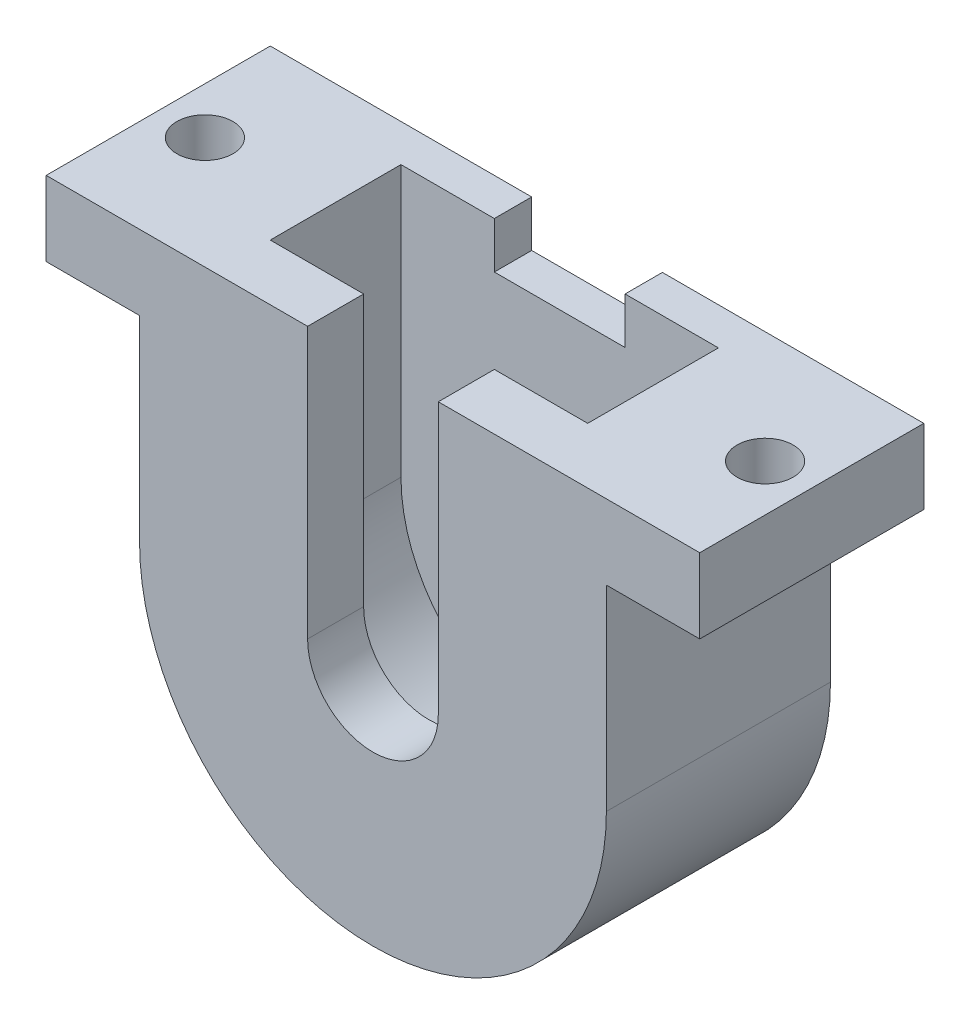
ISO-10303-21;
HEADER;
FILE_DESCRIPTION(('STEP AP214'),'2;1');
FILE_NAME('part.step','',(''),(''),'','','');
FILE_SCHEMA(('AUTOMOTIVE_DESIGN { 1 0 10303 214 1 1 1 1 }'));
ENDSEC;
DATA;
#1=APPLICATION_CONTEXT('core data for automotive mechanical design processes');
#2=APPLICATION_PROTOCOL_DEFINITION('international standard','automotive_design',2000,#1);
#3=PRODUCT_CONTEXT('',#1,'mechanical');
#4=PRODUCT('Part','Part','',(#3));
#5=PRODUCT_RELATED_PRODUCT_CATEGORY('part','',(#4));
#6=PRODUCT_DEFINITION_FORMATION('','',#4);
#7=PRODUCT_DEFINITION_CONTEXT('part definition',#1,'design');
#8=PRODUCT_DEFINITION('design','',#6,#7);
#9=PRODUCT_DEFINITION_SHAPE('','',#8);
#10=(LENGTH_UNIT() NAMED_UNIT(*) SI_UNIT(.MILLI.,.METRE.));
#11=(NAMED_UNIT(*) PLANE_ANGLE_UNIT() SI_UNIT($,.RADIAN.));
#12=(NAMED_UNIT(*) SI_UNIT($,.STERADIAN.) SOLID_ANGLE_UNIT());
#13=UNCERTAINTY_MEASURE_WITH_UNIT(LENGTH_MEASURE(1.E-05),#10,'distance_accuracy_value','');
#14=(GEOMETRIC_REPRESENTATION_CONTEXT(3) GLOBAL_UNCERTAINTY_ASSIGNED_CONTEXT((#13)) GLOBAL_UNIT_ASSIGNED_CONTEXT((#10,
#11,#12)) REPRESENTATION_CONTEXT('',''));
#15=CARTESIAN_POINT('',(0.,0.,0.));
#16=DIRECTION('',(0.,0.,1.));
#17=DIRECTION('',(1.,0.,0.));
#18=AXIS2_PLACEMENT_3D('',#15,#16,#17);
#19=CARTESIAN_POINT('',(8.5,0.,38.));
#20=DIRECTION('',(1.,0.,0.));
#21=DIRECTION('',(0.,0.,-1.));
#22=AXIS2_PLACEMENT_3D('',#19,#20,#21);
#23=PLANE('',#22);
#24=DIRECTION('',(0.,-1.,0.));
#25=VECTOR('',#24,1.);
#26=CARTESIAN_POINT('',(8.5,14.5,31.));
#27=LINE('',#26,#25);
#28=CARTESIAN_POINT('',(8.5,14.5,31.));
#29=VERTEX_POINT('',#28);
#30=CARTESIAN_POINT('',(8.5,0.,31.));
#31=VERTEX_POINT('',#30);
#32=EDGE_CURVE('E48',#29,#31,#27,.T.);
#33=ORIENTED_EDGE('',*,*,#32,.T.);
#34=DIRECTION('',(0.,0.,-1.));
#35=VECTOR('',#34,1.);
#36=CARTESIAN_POINT('',(8.5,0.,38.));
#37=LINE('',#36,#35);
#38=CARTESIAN_POINT('',(8.5,0.,38.));
#39=VERTEX_POINT('',#38);
#40=EDGE_CURVE('E41',#39,#31,#37,.T.);
#41=ORIENTED_EDGE('',*,*,#40,.F.);
#42=DIRECTION('',(0.,-1.,0.));
#43=VECTOR('',#42,1.);
#44=CARTESIAN_POINT('',(8.5,0.,38.));
#45=LINE('',#44,#43);
#46=CARTESIAN_POINT('',(8.5,14.5,38.));
#47=VERTEX_POINT('',#46);
#48=EDGE_CURVE('E322',#47,#39,#45,.T.);
#49=ORIENTED_EDGE('',*,*,#48,.F.);
#50=DIRECTION('',(0.,0.,1.));
#51=VECTOR('',#50,1.);
#52=CARTESIAN_POINT('',(8.5,14.5,38.));
#53=LINE('',#52,#51);
#54=EDGE_CURVE('E253',#29,#47,#53,.T.);
#55=ORIENTED_EDGE('',*,*,#54,.F.);
#56=EDGE_LOOP('',(#33,#41,#49,#55));
#57=FACE_BOUND('',#56,.T.);
#58=ADVANCED_FACE('F33',(#57),#23,.F.);
#59=CARTESIAN_POINT('',(0.,0.,38.));
#60=DIRECTION('',(0.,0.,-1.));
#61=DIRECTION('',(-1.,0.,0.));
#62=AXIS2_PLACEMENT_3D('',#59,#60,#61);
#63=CYLINDRICAL_SURFACE('',#62,8.5);
#64=CARTESIAN_POINT('',(0.,0.,31.));
#65=DIRECTION('',(0.,0.,-1.));
#66=DIRECTION('',(-1.,0.,0.));
#67=AXIS2_PLACEMENT_3D('',#64,#65,#66);
#68=CIRCLE('',#67,8.5);
#69=CARTESIAN_POINT('',(-8.5,0.,31.));
#70=VERTEX_POINT('',#69);
#71=EDGE_CURVE('E55',#31,#70,#68,.T.);
#72=ORIENTED_EDGE('',*,*,#71,.T.);
#73=DIRECTION('',(0.,0.,-1.));
#74=VECTOR('',#73,1.);
#75=CARTESIAN_POINT('',(-8.5,0.,38.));
#76=LINE('',#75,#74);
#77=CARTESIAN_POINT('',(-8.5,0.,38.));
#78=VERTEX_POINT('',#77);
#79=EDGE_CURVE('E339',#78,#70,#76,.T.);
#80=ORIENTED_EDGE('',*,*,#79,.F.);
#81=CARTESIAN_POINT('',(0.,0.,38.));
#82=DIRECTION('',(0.,0.,-1.));
#83=DIRECTION('',(1.,0.,0.));
#84=AXIS2_PLACEMENT_3D('',#81,#82,#83);
#85=CIRCLE('',#84,8.5);
#86=EDGE_CURVE('E325',#39,#78,#85,.T.);
#87=ORIENTED_EDGE('',*,*,#86,.F.);
#88=ORIENTED_EDGE('',*,*,#40,.T.);
#89=EDGE_LOOP('',(#72,#80,#87,#88));
#90=FACE_BOUND('',#89,.T.);
#91=ADVANCED_FACE('F341',(#90),#63,.F.);
#92=CARTESIAN_POINT('',(-8.5,0.,38.));
#93=DIRECTION('',(-1.,0.,0.));
#94=DIRECTION('',(0.,0.,1.));
#95=AXIS2_PLACEMENT_3D('',#92,#93,#94);
#96=PLANE('',#95);
#97=DIRECTION('',(0.,1.,0.));
#98=VECTOR('',#97,1.);
#99=CARTESIAN_POINT('',(-8.5,14.5,31.));
#100=LINE('',#99,#98);
#101=CARTESIAN_POINT('',(-8.5,14.5,31.));
#102=VERTEX_POINT('',#101);
#103=EDGE_CURVE('E199',#70,#102,#100,.T.);
#104=ORIENTED_EDGE('',*,*,#103,.T.);
#105=DIRECTION('',(0.,0.,-1.));
#106=VECTOR('',#105,1.);
#107=CARTESIAN_POINT('',(-8.5,14.5,38.));
#108=LINE('',#107,#106);
#109=CARTESIAN_POINT('',(-8.5,14.5,38.));
#110=VERTEX_POINT('',#109);
#111=EDGE_CURVE('E198',#110,#102,#108,.T.);
#112=ORIENTED_EDGE('',*,*,#111,.F.);
#113=DIRECTION('',(0.,1.,0.));
#114=VECTOR('',#113,1.);
#115=CARTESIAN_POINT('',(-8.5,0.,38.));
#116=LINE('',#115,#114);
#117=EDGE_CURVE('E328',#78,#110,#116,.T.);
#118=ORIENTED_EDGE('',*,*,#117,.F.);
#119=ORIENTED_EDGE('',*,*,#79,.T.);
#120=EDGE_LOOP('',(#104,#112,#118,#119));
#121=FACE_BOUND('',#120,.T.);
#122=ADVANCED_FACE('F346',(#121),#96,.F.);
#123=CARTESIAN_POINT('',(12.5,10.5,38.));
#124=DIRECTION('',(-1.,0.,0.));
#125=DIRECTION('',(0.,0.,1.));
#126=AXIS2_PLACEMENT_3D('',#123,#124,#125);
#127=PLANE('',#126);
#128=DIRECTION('',(0.,0.,-1.));
#129=VECTOR('',#128,1.);
#130=CARTESIAN_POINT('',(12.5,0.,38.));
#131=LINE('',#130,#129);
#132=CARTESIAN_POINT('',(12.5,0.,41.));
#133=VERTEX_POINT('',#132);
#134=CARTESIAN_POINT('',(12.5,0.,29.));
#135=VERTEX_POINT('',#134);
#136=EDGE_CURVE('E330',#133,#135,#131,.T.);
#137=ORIENTED_EDGE('',*,*,#136,.T.);
#138=DIRECTION('',(0.,1.,0.));
#139=VECTOR('',#138,1.);
#140=CARTESIAN_POINT('',(12.5,10.5,29.));
#141=LINE('',#140,#139);
#142=CARTESIAN_POINT('',(12.5,10.5,29.));
#143=VERTEX_POINT('',#142);
#144=EDGE_CURVE('E233',#135,#143,#141,.T.);
#145=ORIENTED_EDGE('',*,*,#144,.T.);
#146=DIRECTION('',(0.,0.,-1.));
#147=VECTOR('',#146,1.);
#148=CARTESIAN_POINT('',(12.5,10.5,38.));
#149=LINE('',#148,#147);
#150=CARTESIAN_POINT('',(12.5,10.5,41.));
#151=VERTEX_POINT('',#150);
#152=EDGE_CURVE('E11',#151,#143,#149,.T.);
#153=ORIENTED_EDGE('',*,*,#152,.F.);
#154=DIRECTION('',(0.,1.,0.));
#155=VECTOR('',#154,1.);
#156=CARTESIAN_POINT('',(12.5,10.5,41.));
#157=LINE('',#156,#155);
#158=EDGE_CURVE('E303',#133,#151,#157,.T.);
#159=ORIENTED_EDGE('',*,*,#158,.F.);
#160=EDGE_LOOP('',(#137,#145,#153,#159));
#161=FACE_BOUND('',#160,.T.);
#162=ADVANCED_FACE('F35',(#161),#127,.F.);
#163=CARTESIAN_POINT('',(-12.5,0.,38.));
#164=DIRECTION('',(1.,0.,0.));
#165=DIRECTION('',(0.,1.,0.));
#166=AXIS2_PLACEMENT_3D('',#163,#164,#165);
#167=PLANE('',#166);
#168=DIRECTION('',(0.,0.,-1.));
#169=VECTOR('',#168,1.);
#170=CARTESIAN_POINT('',(-12.5,10.5,38.));
#171=LINE('',#170,#169);
#172=CARTESIAN_POINT('',(-12.5,10.5,41.));
#173=VERTEX_POINT('',#172);
#174=CARTESIAN_POINT('',(-12.5,10.5,29.));
#175=VERTEX_POINT('',#174);
#176=EDGE_CURVE('E336',#173,#175,#171,.T.);
#177=ORIENTED_EDGE('',*,*,#176,.T.);
#178=DIRECTION('',(0.,-1.,0.));
#179=VECTOR('',#178,1.);
#180=CARTESIAN_POINT('',(-12.5,0.,29.));
#181=LINE('',#180,#179);
#182=CARTESIAN_POINT('',(-12.5,0.,29.));
#183=VERTEX_POINT('',#182);
#184=EDGE_CURVE('E238',#175,#183,#181,.T.);
#185=ORIENTED_EDGE('',*,*,#184,.T.);
#186=DIRECTION('',(0.,0.,-1.));
#187=VECTOR('',#186,1.);
#188=CARTESIAN_POINT('',(-12.5,0.,38.));
#189=LINE('',#188,#187);
#190=CARTESIAN_POINT('',(-12.5,0.,41.));
#191=VERTEX_POINT('',#190);
#192=EDGE_CURVE('E333',#191,#183,#189,.T.);
#193=ORIENTED_EDGE('',*,*,#192,.F.);
#194=DIRECTION('',(0.,-1.,0.));
#195=VECTOR('',#194,1.);
#196=CARTESIAN_POINT('',(-12.5,10.5,41.));
#197=LINE('',#196,#195);
#198=EDGE_CURVE('E296',#173,#191,#197,.T.);
#199=ORIENTED_EDGE('',*,*,#198,.F.);
#200=EDGE_LOOP('',(#177,#185,#193,#199));
#201=FACE_BOUND('',#200,.T.);
#202=ADVANCED_FACE('F411',(#201),#167,.F.);
#203=CARTESIAN_POINT('',(0.,0.,38.));
#204=DIRECTION('',(0.,0.,-1.));
#205=DIRECTION('',(-1.,0.,0.));
#206=AXIS2_PLACEMENT_3D('',#203,#204,#205);
#207=CYLINDRICAL_SURFACE('',#206,12.5);
#208=CARTESIAN_POINT('',(0.,0.,29.));
#209=DIRECTION('',(0.,0.,1.));
#210=DIRECTION('',(1.,0.,0.));
#211=AXIS2_PLACEMENT_3D('',#208,#209,#210);
#212=CIRCLE('',#211,12.5);
#213=EDGE_CURVE('E236',#183,#135,#212,.T.);
#214=ORIENTED_EDGE('',*,*,#213,.T.);
#215=ORIENTED_EDGE('',*,*,#136,.F.);
#216=CARTESIAN_POINT('',(0.,0.,41.));
#217=DIRECTION('',(0.,0.,1.));
#218=DIRECTION('',(1.,0.,0.));
#219=AXIS2_PLACEMENT_3D('',#216,#217,#218);
#220=CIRCLE('',#219,12.5);
#221=EDGE_CURVE('E299',#191,#133,#220,.T.);
#222=ORIENTED_EDGE('',*,*,#221,.F.);
#223=ORIENTED_EDGE('',*,*,#192,.T.);
#224=EDGE_LOOP('',(#214,#215,#222,#223));
#225=FACE_BOUND('',#224,.T.);
#226=ADVANCED_FACE('F414',(#225),#207,.T.);
#227=CARTESIAN_POINT('',(0.,0.,38.));
#228=DIRECTION('',(0.,0.,1.));
#229=DIRECTION('',(1.,0.,0.));
#230=AXIS2_PLACEMENT_3D('',#227,#228,#229);
#231=PLANE('',#230);
#232=DIRECTION('',(0.,-1.,0.));
#233=VECTOR('',#232,1.);
#234=CARTESIAN_POINT('',(3.5,0.,38.));
#235=LINE('',#234,#233);
#236=CARTESIAN_POINT('',(3.5,14.5,38.));
#237=VERTEX_POINT('',#236);
#238=CARTESIAN_POINT('',(3.5,0.,38.));
#239=VERTEX_POINT('',#238);
#240=EDGE_CURVE('E295',#237,#239,#235,.T.);
#241=ORIENTED_EDGE('',*,*,#240,.F.);
#242=DIRECTION('',(-1.,0.,0.));
#243=VECTOR('',#242,1.);
#244=CARTESIAN_POINT('',(8.5,14.5,38.));
#245=LINE('',#244,#243);
#246=EDGE_CURVE('E256',#47,#237,#245,.T.);
#247=ORIENTED_EDGE('',*,*,#246,.F.);
#248=ORIENTED_EDGE('',*,*,#48,.T.);
#249=ORIENTED_EDGE('',*,*,#86,.T.);
#250=ORIENTED_EDGE('',*,*,#117,.T.);
#251=DIRECTION('',(-1.,0.,0.));
#252=VECTOR('',#251,1.);
#253=CARTESIAN_POINT('',(-8.5,14.5,38.));
#254=LINE('',#253,#252);
#255=CARTESIAN_POINT('',(-3.5,14.5,38.));
#256=VERTEX_POINT('',#255);
#257=EDGE_CURVE('E277',#256,#110,#254,.T.);
#258=ORIENTED_EDGE('',*,*,#257,.F.);
#259=DIRECTION('',(0.,1.,0.));
#260=VECTOR('',#259,1.);
#261=CARTESIAN_POINT('',(-3.5,10.5,38.));
#262=LINE('',#261,#260);
#263=CARTESIAN_POINT('',(-3.5,0.,38.));
#264=VERTEX_POINT('',#263);
#265=EDGE_CURVE('E300',#264,#256,#262,.T.);
#266=ORIENTED_EDGE('',*,*,#265,.F.);
#267=CARTESIAN_POINT('',(0.,0.,38.));
#268=DIRECTION('',(0.,0.,-1.));
#269=DIRECTION('',(1.,0.,0.));
#270=AXIS2_PLACEMENT_3D('',#267,#268,#269);
#271=CIRCLE('',#270,3.5);
#272=EDGE_CURVE('E314',#239,#264,#271,.T.);
#273=ORIENTED_EDGE('',*,*,#272,.F.);
#274=EDGE_LOOP('',(#241,#247,#248,#249,#250,#258,#266,#273));
#275=FACE_BOUND('',#274,.T.);
#276=ADVANCED_FACE('F350',(#275),#231,.F.);
#277=CARTESIAN_POINT('',(3.5,0.,41.));
#278=DIRECTION('',(1.,0.,0.));
#279=DIRECTION('',(0.,1.,0.));
#280=AXIS2_PLACEMENT_3D('',#277,#278,#279);
#281=PLANE('',#280);
#282=ORIENTED_EDGE('',*,*,#240,.T.);
#283=DIRECTION('',(0.,0.,-1.));
#284=VECTOR('',#283,1.);
#285=CARTESIAN_POINT('',(3.5,0.,41.));
#286=LINE('',#285,#284);
#287=CARTESIAN_POINT('',(3.5,0.,41.));
#288=VERTEX_POINT('',#287);
#289=EDGE_CURVE('E319',#288,#239,#286,.T.);
#290=ORIENTED_EDGE('',*,*,#289,.F.);
#291=DIRECTION('',(0.,-1.,0.));
#292=VECTOR('',#291,1.);
#293=CARTESIAN_POINT('',(3.5,0.,41.));
#294=LINE('',#293,#292);
#295=CARTESIAN_POINT('',(3.5,14.5,41.));
#296=VERTEX_POINT('',#295);
#297=EDGE_CURVE('E306',#296,#288,#294,.T.);
#298=ORIENTED_EDGE('',*,*,#297,.F.);
#299=DIRECTION('',(0.,0.,1.));
#300=VECTOR('',#299,1.);
#301=CARTESIAN_POINT('',(3.5,14.5,38.));
#302=LINE('',#301,#300);
#303=EDGE_CURVE('E259',#237,#296,#302,.T.);
#304=ORIENTED_EDGE('',*,*,#303,.F.);
#305=EDGE_LOOP('',(#282,#290,#298,#304));
#306=FACE_BOUND('',#305,.T.);
#307=ADVANCED_FACE('F384',(#306),#281,.F.);
#308=CARTESIAN_POINT('',(0.,0.,41.));
#309=DIRECTION('',(0.,0.,-1.));
#310=DIRECTION('',(-1.,0.,0.));
#311=AXIS2_PLACEMENT_3D('',#308,#309,#310);
#312=CYLINDRICAL_SURFACE('',#311,3.5);
#313=ORIENTED_EDGE('',*,*,#272,.T.);
#314=DIRECTION('',(0.,0.,-1.));
#315=VECTOR('',#314,1.);
#316=CARTESIAN_POINT('',(-3.5,0.,41.));
#317=LINE('',#316,#315);
#318=CARTESIAN_POINT('',(-3.5,0.,41.));
#319=VERTEX_POINT('',#318);
#320=EDGE_CURVE('E312',#319,#264,#317,.T.);
#321=ORIENTED_EDGE('',*,*,#320,.F.);
#322=CARTESIAN_POINT('',(0.,0.,41.));
#323=DIRECTION('',(0.,0.,-1.));
#324=DIRECTION('',(1.,0.,0.));
#325=AXIS2_PLACEMENT_3D('',#322,#323,#324);
#326=CIRCLE('',#325,3.5);
#327=EDGE_CURVE('E308',#288,#319,#326,.T.);
#328=ORIENTED_EDGE('',*,*,#327,.F.);
#329=ORIENTED_EDGE('',*,*,#289,.T.);
#330=EDGE_LOOP('',(#313,#321,#328,#329));
#331=FACE_BOUND('',#330,.T.);
#332=ADVANCED_FACE('F380',(#331),#312,.F.);
#333=CARTESIAN_POINT('',(-3.5,10.5,41.));
#334=DIRECTION('',(-1.,0.,0.));
#335=DIRECTION('',(0.,-1.,0.));
#336=AXIS2_PLACEMENT_3D('',#333,#334,#335);
#337=PLANE('',#336);
#338=ORIENTED_EDGE('',*,*,#265,.T.);
#339=DIRECTION('',(0.,0.,-1.));
#340=VECTOR('',#339,1.);
#341=CARTESIAN_POINT('',(-3.5,14.5,38.));
#342=LINE('',#341,#340);
#343=CARTESIAN_POINT('',(-3.5,14.5,41.));
#344=VERTEX_POINT('',#343);
#345=EDGE_CURVE('E286',#344,#256,#342,.T.);
#346=ORIENTED_EDGE('',*,*,#345,.F.);
#347=DIRECTION('',(0.,1.,0.));
#348=VECTOR('',#347,1.);
#349=CARTESIAN_POINT('',(-3.5,10.5,41.));
#350=LINE('',#349,#348);
#351=EDGE_CURVE('E310',#319,#344,#350,.T.);
#352=ORIENTED_EDGE('',*,*,#351,.F.);
#353=ORIENTED_EDGE('',*,*,#320,.T.);
#354=EDGE_LOOP('',(#338,#346,#352,#353));
#355=FACE_BOUND('',#354,.T.);
#356=ADVANCED_FACE('F375',(#355),#337,.F.);
#357=CARTESIAN_POINT('',(0.,0.,41.));
#358=DIRECTION('',(0.,0.,1.));
#359=DIRECTION('',(1.,0.,0.));
#360=AXIS2_PLACEMENT_3D('',#357,#358,#359);
#361=PLANE('',#360);
#362=ORIENTED_EDGE('',*,*,#198,.T.);
#363=ORIENTED_EDGE('',*,*,#221,.T.);
#364=ORIENTED_EDGE('',*,*,#158,.T.);
#365=DIRECTION('',(1.,0.,0.));
#366=VECTOR('',#365,1.);
#367=CARTESIAN_POINT('',(17.5,10.5,41.));
#368=LINE('',#367,#366);
#369=CARTESIAN_POINT('',(17.5,10.5,41.));
#370=VERTEX_POINT('',#369);
#371=EDGE_CURVE('E254',#151,#370,#368,.T.);
#372=ORIENTED_EDGE('',*,*,#371,.T.);
#373=DIRECTION('',(0.,-1.,0.));
#374=VECTOR('',#373,1.);
#375=CARTESIAN_POINT('',(17.5,14.5,41.));
#376=LINE('',#375,#374);
#377=CARTESIAN_POINT('',(17.5,14.5,41.));
#378=VERTEX_POINT('',#377);
#379=EDGE_CURVE('E264',#378,#370,#376,.T.);
#380=ORIENTED_EDGE('',*,*,#379,.F.);
#381=DIRECTION('',(1.,0.,0.));
#382=VECTOR('',#381,1.);
#383=CARTESIAN_POINT('',(17.5,14.5,41.));
#384=LINE('',#383,#382);
#385=EDGE_CURVE('E262',#296,#378,#384,.T.);
#386=ORIENTED_EDGE('',*,*,#385,.F.);
#387=ORIENTED_EDGE('',*,*,#297,.T.);
#388=ORIENTED_EDGE('',*,*,#327,.T.);
#389=ORIENTED_EDGE('',*,*,#351,.T.);
#390=DIRECTION('',(1.,0.,0.));
#391=VECTOR('',#390,1.);
#392=CARTESIAN_POINT('',(-3.5,14.5,41.));
#393=LINE('',#392,#391);
#394=CARTESIAN_POINT('',(-17.5,14.5,41.));
#395=VERTEX_POINT('',#394);
#396=EDGE_CURVE('E283',#395,#344,#393,.T.);
#397=ORIENTED_EDGE('',*,*,#396,.F.);
#398=DIRECTION('',(0.,-1.,0.));
#399=VECTOR('',#398,1.);
#400=CARTESIAN_POINT('',(-17.5,14.5,41.));
#401=LINE('',#400,#399);
#402=CARTESIAN_POINT('',(-17.5,10.5,41.));
#403=VERTEX_POINT('',#402);
#404=EDGE_CURVE('E289',#395,#403,#401,.T.);
#405=ORIENTED_EDGE('',*,*,#404,.T.);
#406=DIRECTION('',(1.,0.,0.));
#407=VECTOR('',#406,1.);
#408=CARTESIAN_POINT('',(-3.5,10.5,41.));
#409=LINE('',#408,#407);
#410=EDGE_CURVE('E279',#403,#173,#409,.T.);
#411=ORIENTED_EDGE('',*,*,#410,.T.);
#412=EDGE_LOOP('',(#362,#363,#364,#372,#380,#386,#387,#388,#389,#397,#405,#411));
#413=FACE_BOUND('',#412,.T.);
#414=ADVANCED_FACE('F371',(#413),#361,.T.);
#415=CARTESIAN_POINT('',(0.,10.5,0.));
#416=DIRECTION('',(0.,-1.,0.));
#417=DIRECTION('',(0.,0.,-1.));
#418=AXIS2_PLACEMENT_3D('',#415,#416,#417);
#419=PLANE('',#418);
#420=DIRECTION('',(-1.,0.,0.));
#421=VECTOR('',#420,1.);
#422=CARTESIAN_POINT('',(0.,10.5,29.));
#423=LINE('',#422,#421);
#424=CARTESIAN_POINT('',(-17.5,10.5,29.));
#425=VERTEX_POINT('',#424);
#426=EDGE_CURVE('E241',#175,#425,#423,.T.);
#427=ORIENTED_EDGE('',*,*,#426,.F.);
#428=ORIENTED_EDGE('',*,*,#176,.F.);
#429=ORIENTED_EDGE('',*,*,#410,.F.);
#430=DIRECTION('',(0.,0.,1.));
#431=VECTOR('',#430,1.);
#432=CARTESIAN_POINT('',(-17.5,10.5,41.));
#433=LINE('',#432,#431);
#434=EDGE_CURVE('E274',#425,#403,#433,.T.);
#435=ORIENTED_EDGE('',*,*,#434,.F.);
#436=EDGE_LOOP('',(#427,#428,#429,#435));
#437=FACE_BOUND('',#436,.T.);
#438=CARTESIAN_POINT('',(-14.9999999999997,10.5,35.));
#439=DIRECTION('',(0.,1.,0.));
#440=DIRECTION('',(0.,0.,1.));
#441=AXIS2_PLACEMENT_3D('',#438,#439,#440);
#442=CIRCLE('',#441,1.5);
#443=CARTESIAN_POINT('',(-14.9999999999997,10.5,36.5));
#444=VERTEX_POINT('',#443);
#445=EDGE_CURVE('E270',#444,#444,#442,.T.);
#446=ORIENTED_EDGE('',*,*,#445,.T.);
#447=EDGE_LOOP('',(#446));
#448=FACE_BOUND('',#447,.T.);
#449=ADVANCED_FACE('F429',(#437,#448),#419,.T.);
#450=CARTESIAN_POINT('',(0.,14.5,0.));
#451=DIRECTION('',(0.,-1.,0.));
#452=DIRECTION('',(0.,0.,-1.));
#453=AXIS2_PLACEMENT_3D('',#450,#451,#452);
#454=PLANE('',#453);
#455=ORIENTED_EDGE('',*,*,#111,.T.);
#456=DIRECTION('',(1.,0.,0.));
#457=VECTOR('',#456,1.);
#458=CARTESIAN_POINT('',(-3.5,14.5,31.));
#459=LINE('',#458,#457);
#460=CARTESIAN_POINT('',(-3.5,14.5,31.));
#461=VERTEX_POINT('',#460);
#462=EDGE_CURVE('E188',#102,#461,#459,.T.);
#463=ORIENTED_EDGE('',*,*,#462,.T.);
#464=DIRECTION('',(0.,0.,-1.));
#465=VECTOR('',#464,1.);
#466=CARTESIAN_POINT('',(-3.5,14.5,31.));
#467=LINE('',#466,#465);
#468=CARTESIAN_POINT('',(-3.5,14.5,29.));
#469=VERTEX_POINT('',#468);
#470=EDGE_CURVE('E171',#461,#469,#467,.T.);
#471=ORIENTED_EDGE('',*,*,#470,.T.);
#472=DIRECTION('',(-1.,0.,0.));
#473=VECTOR('',#472,1.);
#474=CARTESIAN_POINT('',(-17.5,14.5,29.));
#475=LINE('',#474,#473);
#476=CARTESIAN_POINT('',(-17.5,14.5,29.));
#477=VERTEX_POINT('',#476);
#478=EDGE_CURVE('E220',#469,#477,#475,.T.);
#479=ORIENTED_EDGE('',*,*,#478,.T.);
#480=DIRECTION('',(0.,0.,1.));
#481=VECTOR('',#480,1.);
#482=CARTESIAN_POINT('',(-17.5,14.5,41.));
#483=LINE('',#482,#481);
#484=EDGE_CURVE('E281',#477,#395,#483,.T.);
#485=ORIENTED_EDGE('',*,*,#484,.T.);
#486=ORIENTED_EDGE('',*,*,#396,.T.);
#487=ORIENTED_EDGE('',*,*,#345,.T.);
#488=ORIENTED_EDGE('',*,*,#257,.T.);
#489=EDGE_LOOP('',(#455,#463,#471,#479,#485,#486,#487,#488));
#490=FACE_BOUND('',#489,.T.);
#491=CARTESIAN_POINT('',(-14.9999999999997,14.5,35.));
#492=DIRECTION('',(0.,1.,0.));
#493=DIRECTION('',(0.,0.,1.));
#494=AXIS2_PLACEMENT_3D('',#491,#492,#493);
#495=CIRCLE('',#494,1.5);
#496=CARTESIAN_POINT('',(-14.9999999999997,14.5,36.5));
#497=VERTEX_POINT('',#496);
#498=EDGE_CURVE('E271',#497,#497,#495,.T.);
#499=ORIENTED_EDGE('',*,*,#498,.F.);
#500=EDGE_LOOP('',(#499));
#501=FACE_BOUND('',#500,.T.);
#502=ADVANCED_FACE('F194',(#490,#501),#454,.F.);
#503=CARTESIAN_POINT('',(-17.5,14.5,41.));
#504=DIRECTION('',(1.,0.,0.));
#505=DIRECTION('',(0.,0.,-1.));
#506=AXIS2_PLACEMENT_3D('',#503,#504,#505);
#507=PLANE('',#506);
#508=ORIENTED_EDGE('',*,*,#484,.F.);
#509=DIRECTION('',(0.,-1.,0.));
#510=VECTOR('',#509,1.);
#511=CARTESIAN_POINT('',(-17.5,14.5,29.));
#512=LINE('',#511,#510);
#513=EDGE_CURVE('E227',#477,#425,#512,.T.);
#514=ORIENTED_EDGE('',*,*,#513,.T.);
#515=ORIENTED_EDGE('',*,*,#434,.T.);
#516=ORIENTED_EDGE('',*,*,#404,.F.);
#517=EDGE_LOOP('',(#508,#514,#515,#516));
#518=FACE_BOUND('',#517,.T.);
#519=ADVANCED_FACE('F366',(#518),#507,.F.);
#520=CARTESIAN_POINT('',(-14.9999999999997,14.5,35.));
#521=DIRECTION('',(0.,-1.,0.));
#522=DIRECTION('',(0.,0.,-1.));
#523=AXIS2_PLACEMENT_3D('',#520,#521,#522);
#524=CYLINDRICAL_SURFACE('',#523,1.5);
#525=ORIENTED_EDGE('',*,*,#498,.T.);
#526=EDGE_LOOP('',(#525));
#527=FACE_BOUND('',#526,.T.);
#528=ORIENTED_EDGE('',*,*,#445,.F.);
#529=EDGE_LOOP('',(#528));
#530=FACE_BOUND('',#529,.T.);
#531=ADVANCED_FACE('F432',(#527,#530),#524,.F.);
#532=CARTESIAN_POINT('',(0.,10.5,0.));
#533=DIRECTION('',(0.,-1.,0.));
#534=DIRECTION('',(0.,0.,-1.));
#535=AXIS2_PLACEMENT_3D('',#532,#533,#534);
#536=PLANE('',#535);
#537=DIRECTION('',(-1.,0.,0.));
#538=VECTOR('',#537,1.);
#539=CARTESIAN_POINT('',(0.,10.5,29.));
#540=LINE('',#539,#538);
#541=CARTESIAN_POINT('',(17.5,10.5,29.));
#542=VERTEX_POINT('',#541);
#543=EDGE_CURVE('E230',#542,#143,#540,.T.);
#544=ORIENTED_EDGE('',*,*,#543,.F.);
#545=DIRECTION('',(0.,0.,-1.));
#546=VECTOR('',#545,1.);
#547=CARTESIAN_POINT('',(17.5,10.5,26.565627665077));
#548=LINE('',#547,#546);
#549=EDGE_CURVE('E247',#370,#542,#548,.T.);
#550=ORIENTED_EDGE('',*,*,#549,.F.);
#551=ORIENTED_EDGE('',*,*,#371,.F.);
#552=ORIENTED_EDGE('',*,*,#152,.T.);
#553=EDGE_LOOP('',(#544,#550,#551,#552));
#554=FACE_BOUND('',#553,.T.);
#555=CARTESIAN_POINT('',(15.0000000000003,10.5,35.));
#556=DIRECTION('',(0.,1.,0.));
#557=DIRECTION('',(0.,0.,1.));
#558=AXIS2_PLACEMENT_3D('',#555,#556,#557);
#559=CIRCLE('',#558,1.5);
#560=CARTESIAN_POINT('',(15.0000000000003,10.5,36.5));
#561=VERTEX_POINT('',#560);
#562=EDGE_CURVE('E243',#561,#561,#559,.T.);
#563=ORIENTED_EDGE('',*,*,#562,.T.);
#564=EDGE_LOOP('',(#563));
#565=FACE_BOUND('',#564,.T.);
#566=ADVANCED_FACE('F440',(#554,#565),#536,.T.);
#567=CARTESIAN_POINT('',(0.,14.5,0.));
#568=DIRECTION('',(0.,-1.,0.));
#569=DIRECTION('',(0.,0.,-1.));
#570=AXIS2_PLACEMENT_3D('',#567,#568,#569);
#571=PLANE('',#570);
#572=DIRECTION('',(0.,0.,-1.));
#573=VECTOR('',#572,1.);
#574=CARTESIAN_POINT('',(17.5,14.5,26.565627665077));
#575=LINE('',#574,#573);
#576=CARTESIAN_POINT('',(17.5,14.5,29.));
#577=VERTEX_POINT('',#576);
#578=EDGE_CURVE('E250',#378,#577,#575,.T.);
#579=ORIENTED_EDGE('',*,*,#578,.T.);
#580=CARTESIAN_POINT('',(3.5,14.5,29.));
#581=VERTEX_POINT('',#580);
#582=EDGE_CURVE('E224',#577,#581,#475,.T.);
#583=ORIENTED_EDGE('',*,*,#582,.T.);
#584=DIRECTION('',(0.,0.,-1.));
#585=VECTOR('',#584,1.);
#586=CARTESIAN_POINT('',(3.5,14.5,31.));
#587=LINE('',#586,#585);
#588=CARTESIAN_POINT('',(3.5,14.5,31.));
#589=VERTEX_POINT('',#588);
#590=EDGE_CURVE('E217',#589,#581,#587,.T.);
#591=ORIENTED_EDGE('',*,*,#590,.F.);
#592=DIRECTION('',(1.,0.,0.));
#593=VECTOR('',#592,1.);
#594=CARTESIAN_POINT('',(8.5,14.5,31.));
#595=LINE('',#594,#593);
#596=EDGE_CURVE('E181',#589,#29,#595,.T.);
#597=ORIENTED_EDGE('',*,*,#596,.T.);
#598=ORIENTED_EDGE('',*,*,#54,.T.);
#599=ORIENTED_EDGE('',*,*,#246,.T.);
#600=ORIENTED_EDGE('',*,*,#303,.T.);
#601=ORIENTED_EDGE('',*,*,#385,.T.);
#602=EDGE_LOOP('',(#579,#583,#591,#597,#598,#599,#600,#601));
#603=FACE_BOUND('',#602,.T.);
#604=CARTESIAN_POINT('',(15.0000000000003,14.5,35.));
#605=DIRECTION('',(0.,1.,0.));
#606=DIRECTION('',(0.,0.,1.));
#607=AXIS2_PLACEMENT_3D('',#604,#605,#606);
#608=CIRCLE('',#607,1.5);
#609=CARTESIAN_POINT('',(15.0000000000003,14.5,36.5));
#610=VERTEX_POINT('',#609);
#611=EDGE_CURVE('E244',#610,#610,#608,.T.);
#612=ORIENTED_EDGE('',*,*,#611,.F.);
#613=EDGE_LOOP('',(#612));
#614=FACE_BOUND('',#613,.T.);
#615=ADVANCED_FACE('F353',(#603,#614),#571,.F.);
#616=CARTESIAN_POINT('',(17.5,14.5,26.565627665077));
#617=DIRECTION('',(-1.,0.,0.));
#618=DIRECTION('',(0.,0.,1.));
#619=AXIS2_PLACEMENT_3D('',#616,#617,#618);
#620=PLANE('',#619);
#621=ORIENTED_EDGE('',*,*,#549,.T.);
#622=DIRECTION('',(0.,-1.,0.));
#623=VECTOR('',#622,1.);
#624=CARTESIAN_POINT('',(17.5,14.5,29.));
#625=LINE('',#624,#623);
#626=EDGE_CURVE('E226',#577,#542,#625,.T.);
#627=ORIENTED_EDGE('',*,*,#626,.F.);
#628=ORIENTED_EDGE('',*,*,#578,.F.);
#629=ORIENTED_EDGE('',*,*,#379,.T.);
#630=EDGE_LOOP('',(#621,#627,#628,#629));
#631=FACE_BOUND('',#630,.T.);
#632=ADVANCED_FACE('F391',(#631),#620,.F.);
#633=CARTESIAN_POINT('',(15.0000000000003,14.5,35.));
#634=DIRECTION('',(0.,-1.,0.));
#635=DIRECTION('',(0.,0.,-1.));
#636=AXIS2_PLACEMENT_3D('',#633,#634,#635);
#637=CYLINDRICAL_SURFACE('',#636,1.5);
#638=ORIENTED_EDGE('',*,*,#611,.T.);
#639=EDGE_LOOP('',(#638));
#640=FACE_BOUND('',#639,.T.);
#641=ORIENTED_EDGE('',*,*,#562,.F.);
#642=EDGE_LOOP('',(#641));
#643=FACE_BOUND('',#642,.T.);
#644=ADVANCED_FACE('F400',(#640,#643),#637,.F.);
#645=CARTESIAN_POINT('',(-17.5,14.5,29.));
#646=DIRECTION('',(0.,0.,1.));
#647=DIRECTION('',(1.,0.,0.));
#648=AXIS2_PLACEMENT_3D('',#645,#646,#647);
#649=PLANE('',#648);
#650=ORIENTED_EDGE('',*,*,#478,.F.);
#651=DIRECTION('',(0.,-1.,0.));
#652=VECTOR('',#651,1.);
#653=CARTESIAN_POINT('',(-3.5,12.0175427079506,29.));
#654=LINE('',#653,#652);
#655=CARTESIAN_POINT('',(-3.5,12.0175427079506,29.));
#656=VERTEX_POINT('',#655);
#657=EDGE_CURVE('E176',#469,#656,#654,.T.);
#658=ORIENTED_EDGE('',*,*,#657,.T.);
#659=DIRECTION('',(1.,0.,0.));
#660=VECTOR('',#659,1.);
#661=CARTESIAN_POINT('',(3.5,12.0175427079506,29.));
#662=LINE('',#661,#660);
#663=CARTESIAN_POINT('',(3.5,12.0175427079506,29.));
#664=VERTEX_POINT('',#663);
#665=EDGE_CURVE('E211',#656,#664,#662,.T.);
#666=ORIENTED_EDGE('',*,*,#665,.T.);
#667=DIRECTION('',(0.,1.,0.));
#668=VECTOR('',#667,1.);
#669=CARTESIAN_POINT('',(3.5,14.5,29.));
#670=LINE('',#669,#668);
#671=EDGE_CURVE('E214',#664,#581,#670,.T.);
#672=ORIENTED_EDGE('',*,*,#671,.T.);
#673=ORIENTED_EDGE('',*,*,#582,.F.);
#674=ORIENTED_EDGE('',*,*,#626,.T.);
#675=ORIENTED_EDGE('',*,*,#543,.T.);
#676=ORIENTED_EDGE('',*,*,#144,.F.);
#677=ORIENTED_EDGE('',*,*,#213,.F.);
#678=ORIENTED_EDGE('',*,*,#184,.F.);
#679=ORIENTED_EDGE('',*,*,#426,.T.);
#680=ORIENTED_EDGE('',*,*,#513,.F.);
#681=EDGE_LOOP('',(#650,#658,#666,#672,#673,#674,#675,#676,#677,#678,#679,#680));
#682=FACE_BOUND('',#681,.T.);
#683=ADVANCED_FACE('F362',(#682),#649,.F.);
#684=CARTESIAN_POINT('',(3.5,14.5,31.));
#685=DIRECTION('',(-1.,0.,0.));
#686=DIRECTION('',(0.,-1.,0.));
#687=AXIS2_PLACEMENT_3D('',#684,#685,#686);
#688=PLANE('',#687);
#689=ORIENTED_EDGE('',*,*,#671,.F.);
#690=DIRECTION('',(0.,0.,-1.));
#691=VECTOR('',#690,1.);
#692=CARTESIAN_POINT('',(3.5,12.0175427079506,31.));
#693=LINE('',#692,#691);
#694=CARTESIAN_POINT('',(3.5,12.0175427079506,31.));
#695=VERTEX_POINT('',#694);
#696=EDGE_CURVE('E221',#695,#664,#693,.T.);
#697=ORIENTED_EDGE('',*,*,#696,.F.);
#698=DIRECTION('',(0.,1.,0.));
#699=VECTOR('',#698,1.);
#700=CARTESIAN_POINT('',(3.5,14.5,31.));
#701=LINE('',#700,#699);
#702=EDGE_CURVE('E205',#695,#589,#701,.T.);
#703=ORIENTED_EDGE('',*,*,#702,.T.);
#704=ORIENTED_EDGE('',*,*,#590,.T.);
#705=EDGE_LOOP('',(#689,#697,#703,#704));
#706=FACE_BOUND('',#705,.T.);
#707=ADVANCED_FACE('F392',(#706),#688,.T.);
#708=CARTESIAN_POINT('',(3.5,12.0175427079506,31.));
#709=DIRECTION('',(0.,1.,0.));
#710=DIRECTION('',(-1.,0.,0.));
#711=AXIS2_PLACEMENT_3D('',#708,#709,#710);
#712=PLANE('',#711);
#713=ORIENTED_EDGE('',*,*,#665,.F.);
#714=DIRECTION('',(0.,0.,-1.));
#715=VECTOR('',#714,1.);
#716=CARTESIAN_POINT('',(-3.5,12.0175427079506,31.));
#717=LINE('',#716,#715);
#718=CARTESIAN_POINT('',(-3.5,12.0175427079506,31.));
#719=VERTEX_POINT('',#718);
#720=EDGE_CURVE('E180',#719,#656,#717,.T.);
#721=ORIENTED_EDGE('',*,*,#720,.F.);
#722=DIRECTION('',(1.,0.,0.));
#723=VECTOR('',#722,1.);
#724=CARTESIAN_POINT('',(3.5,12.0175427079506,31.));
#725=LINE('',#724,#723);
#726=EDGE_CURVE('E191',#719,#695,#725,.T.);
#727=ORIENTED_EDGE('',*,*,#726,.T.);
#728=ORIENTED_EDGE('',*,*,#696,.T.);
#729=EDGE_LOOP('',(#713,#721,#727,#728));
#730=FACE_BOUND('',#729,.T.);
#731=ADVANCED_FACE('F359',(#730),#712,.T.);
#732=CARTESIAN_POINT('',(-3.5,12.0175427079506,31.));
#733=DIRECTION('',(1.,0.,0.));
#734=DIRECTION('',(0.,1.,0.));
#735=AXIS2_PLACEMENT_3D('',#732,#733,#734);
#736=PLANE('',#735);
#737=ORIENTED_EDGE('',*,*,#657,.F.);
#738=ORIENTED_EDGE('',*,*,#470,.F.);
#739=DIRECTION('',(0.,-1.,0.));
#740=VECTOR('',#739,1.);
#741=CARTESIAN_POINT('',(-3.5,12.0175427079506,31.));
#742=LINE('',#741,#740);
#743=EDGE_CURVE('E174',#461,#719,#742,.T.);
#744=ORIENTED_EDGE('',*,*,#743,.T.);
#745=ORIENTED_EDGE('',*,*,#720,.T.);
#746=EDGE_LOOP('',(#737,#738,#744,#745));
#747=FACE_BOUND('',#746,.T.);
#748=ADVANCED_FACE('F173',(#747),#736,.T.);
#749=CARTESIAN_POINT('',(0.,0.,31.));
#750=DIRECTION('',(0.,0.,-1.));
#751=DIRECTION('',(-1.,0.,0.));
#752=AXIS2_PLACEMENT_3D('',#749,#750,#751);
#753=PLANE('',#752);
#754=ORIENTED_EDGE('',*,*,#32,.F.);
#755=ORIENTED_EDGE('',*,*,#596,.F.);
#756=ORIENTED_EDGE('',*,*,#702,.F.);
#757=ORIENTED_EDGE('',*,*,#726,.F.);
#758=ORIENTED_EDGE('',*,*,#743,.F.);
#759=ORIENTED_EDGE('',*,*,#462,.F.);
#760=ORIENTED_EDGE('',*,*,#103,.F.);
#761=ORIENTED_EDGE('',*,*,#71,.F.);
#762=EDGE_LOOP('',(#754,#755,#756,#757,#758,#759,#760,#761));
#763=FACE_BOUND('',#762,.T.);
#764=ADVANCED_FACE('F186',(#763),#753,.F.);
#765=CLOSED_SHELL('',(#58,#91,#122,#162,#202,#226,#276,#307,#332,#356,#414,#449,#502,#519,#531,
#566,#615,#632,#644,#683,#707,#731,#748,#764));
#766=MANIFOLD_SOLID_BREP('B2',#765);
#767=ADVANCED_BREP_SHAPE_REPRESENTATION('',(#18,#766),#14);
#768=SHAPE_DEFINITION_REPRESENTATION(#9,#767);
ENDSEC;
END-ISO-10303-21;
